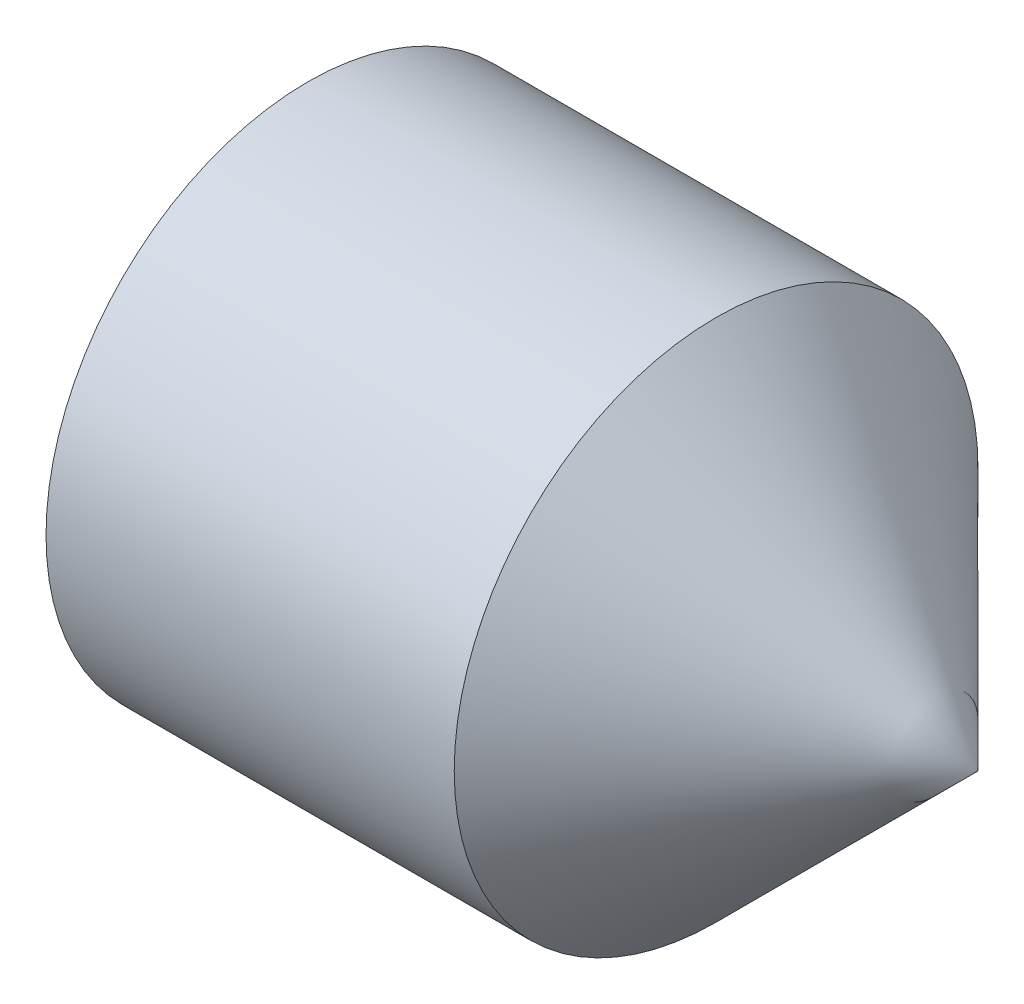
ISO-10303-21;
HEADER;
FILE_DESCRIPTION(('STEP AP214'),'2;1');
FILE_NAME('part.step','',(''),(''),'','','');
FILE_SCHEMA(('AUTOMOTIVE_DESIGN { 1 0 10303 214 1 1 1 1 }'));
ENDSEC;
DATA;
#1=APPLICATION_CONTEXT('core data for automotive mechanical design processes');
#2=APPLICATION_PROTOCOL_DEFINITION('international standard','automotive_design',2000,#1);
#3=PRODUCT_CONTEXT('',#1,'mechanical');
#4=PRODUCT('Part','Part','',(#3));
#5=PRODUCT_RELATED_PRODUCT_CATEGORY('part','',(#4));
#6=PRODUCT_DEFINITION_FORMATION('','',#4);
#7=PRODUCT_DEFINITION_CONTEXT('part definition',#1,'design');
#8=PRODUCT_DEFINITION('design','',#6,#7);
#9=PRODUCT_DEFINITION_SHAPE('','',#8);
#10=(LENGTH_UNIT() NAMED_UNIT(*) SI_UNIT(.MILLI.,.METRE.));
#11=(NAMED_UNIT(*) PLANE_ANGLE_UNIT() SI_UNIT($,.RADIAN.));
#12=(NAMED_UNIT(*) SI_UNIT($,.STERADIAN.) SOLID_ANGLE_UNIT());
#13=UNCERTAINTY_MEASURE_WITH_UNIT(LENGTH_MEASURE(1.E-05),#10,'distance_accuracy_value','');
#14=(GEOMETRIC_REPRESENTATION_CONTEXT(3) GLOBAL_UNCERTAINTY_ASSIGNED_CONTEXT((#13)) GLOBAL_UNIT_ASSIGNED_CONTEXT((#10,
#11,#12)) REPRESENTATION_CONTEXT('',''));
#15=CARTESIAN_POINT('',(0.,0.,0.));
#16=DIRECTION('',(0.,0.,1.));
#17=DIRECTION('',(1.,0.,0.));
#18=AXIS2_PLACEMENT_3D('',#15,#16,#17);
#19=CARTESIAN_POINT('',(0.,0.,0.));
#20=DIRECTION('',(-1.,0.,0.));
#21=DIRECTION('',(0.,0.,1.));
#22=AXIS2_PLACEMENT_3D('',#19,#20,#21);
#23=PLANE('',#22);
#24=CARTESIAN_POINT('',(0.,0.,0.));
#25=DIRECTION('',(-1.,0.,0.));
#26=DIRECTION('',(0.,0.,1.));
#27=AXIS2_PLACEMENT_3D('',#24,#25,#26);
#28=CIRCLE('',#27,1.2195);
#29=CARTESIAN_POINT('',(0.,0.,1.2195));
#30=VERTEX_POINT('',#29);
#31=EDGE_CURVE('E13',#30,#30,#28,.T.);
#32=ORIENTED_EDGE('',*,*,#31,.T.);
#33=EDGE_LOOP('',(#32));
#34=FACE_BOUND('',#33,.T.);
#35=DIRECTION('',(0.,0.,-1.));
#36=VECTOR('',#35,1.);
#37=CARTESIAN_POINT('',(0.,0.750000000000003,0.433012701892217));
#38=LINE('',#37,#36);
#39=CARTESIAN_POINT('',(0.,0.750000000000003,0.433012701892217));
#40=VERTEX_POINT('',#39);
#41=CARTESIAN_POINT('',(0.,0.750000000000003,-0.433012701892222));
#42=VERTEX_POINT('',#41);
#43=EDGE_CURVE('E107',#40,#42,#38,.T.);
#44=ORIENTED_EDGE('',*,*,#43,.F.);
#45=DIRECTION('',(0.,-0.866025403784439,0.5));
#46=VECTOR('',#45,1.);
#47=CARTESIAN_POINT('',(0.,0.750000000000003,0.433012701892217));
#48=LINE('',#47,#46);
#49=CARTESIAN_POINT('',(0.,0.,0.866025403784436));
#50=VERTEX_POINT('',#49);
#51=EDGE_CURVE('E60',#40,#50,#48,.T.);
#52=ORIENTED_EDGE('',*,*,#51,.T.);
#53=DIRECTION('',(0.,0.866025403784439,0.5));
#54=VECTOR('',#53,1.);
#55=CARTESIAN_POINT('',(0.,-0.749999999999997,0.433012701892217));
#56=LINE('',#55,#54);
#57=CARTESIAN_POINT('',(0.,-0.749999999999997,0.433012701892217));
#58=VERTEX_POINT('',#57);
#59=EDGE_CURVE('E113',#58,#50,#56,.T.);
#60=ORIENTED_EDGE('',*,*,#59,.F.);
#61=DIRECTION('',(0.,0.,-1.));
#62=VECTOR('',#61,1.);
#63=CARTESIAN_POINT('',(0.,-0.749999999999997,0.433012701892217));
#64=LINE('',#63,#62);
#65=CARTESIAN_POINT('',(0.,-0.749999999999997,-0.433012701892222));
#66=VERTEX_POINT('',#65);
#67=EDGE_CURVE('E133',#58,#66,#64,.T.);
#68=ORIENTED_EDGE('',*,*,#67,.T.);
#69=DIRECTION('',(0.,0.866025403784438,-0.5));
#70=VECTOR('',#69,1.);
#71=CARTESIAN_POINT('',(0.,-0.749999999999997,-0.433012701892222));
#72=LINE('',#71,#70);
#73=CARTESIAN_POINT('',(0.,0.,-0.866025403784441));
#74=VERTEX_POINT('',#73);
#75=EDGE_CURVE('E136',#66,#74,#72,.T.);
#76=ORIENTED_EDGE('',*,*,#75,.T.);
#77=DIRECTION('',(0.,-0.866025403784439,-0.5));
#78=VECTOR('',#77,1.);
#79=CARTESIAN_POINT('',(0.,0.750000000000003,-0.433012701892222));
#80=LINE('',#79,#78);
#81=EDGE_CURVE('E139',#42,#74,#80,.T.);
#82=ORIENTED_EDGE('',*,*,#81,.F.);
#83=EDGE_LOOP('',(#44,#52,#60,#68,#76,#82));
#84=FACE_BOUND('',#83,.T.);
#85=ADVANCED_FACE('F46',(#34,#84),#23,.T.);
#86=CARTESIAN_POINT('',(0.,0.,0.));
#87=DIRECTION('',(1.,0.,0.));
#88=DIRECTION('',(0.,0.,-1.));
#89=AXIS2_PLACEMENT_3D('',#86,#87,#88);
#90=CONICAL_SURFACE('',#89,1.2195,1.0471975511966);
#91=CARTESIAN_POINT('',(0.161946750507689,0.,0.));
#92=DIRECTION('',(-1.,0.,0.));
#93=DIRECTION('',(0.,0.,1.));
#94=AXIS2_PLACEMENT_3D('',#91,#92,#93);
#95=CIRCLE('',#94,1.5);
#96=CARTESIAN_POINT('',(0.161946750507689,0.,1.5));
#97=VERTEX_POINT('',#96);
#98=EDGE_CURVE('E53',#97,#97,#95,.T.);
#99=ORIENTED_EDGE('',*,*,#98,.T.);
#100=EDGE_LOOP('',(#99));
#101=FACE_BOUND('',#100,.T.);
#102=ORIENTED_EDGE('',*,*,#31,.F.);
#103=EDGE_LOOP('',(#102));
#104=FACE_BOUND('',#103,.T.);
#105=ADVANCED_FACE('F156',(#101,#104),#90,.T.);
#106=CARTESIAN_POINT('',(-12.7,0.,0.));
#107=DIRECTION('',(-1.,0.,0.));
#108=DIRECTION('',(0.,0.,1.));
#109=AXIS2_PLACEMENT_3D('',#106,#107,#108);
#110=CYLINDRICAL_SURFACE('',#109,1.5);
#111=CARTESIAN_POINT('',(2.50000000000001,0.,0.));
#112=DIRECTION('',(-1.,0.,0.));
#113=DIRECTION('',(0.,0.,1.));
#114=AXIS2_PLACEMENT_3D('',#111,#112,#113);
#115=CIRCLE('',#114,1.5);
#116=CARTESIAN_POINT('',(2.50000000000001,0.,1.5));
#117=VERTEX_POINT('',#116);
#118=EDGE_CURVE('E114',#117,#117,#115,.T.);
#119=ORIENTED_EDGE('',*,*,#118,.T.);
#120=EDGE_LOOP('',(#119));
#121=FACE_BOUND('',#120,.T.);
#122=ORIENTED_EDGE('',*,*,#98,.F.);
#123=EDGE_LOOP('',(#122));
#124=FACE_BOUND('',#123,.T.);
#125=ADVANCED_FACE('F159',(#121,#124),#110,.T.);
#126=CARTESIAN_POINT('',(2.50000000000001,0.,0.));
#127=DIRECTION('',(-1.,0.,0.));
#128=DIRECTION('',(0.,0.,1.));
#129=AXIS2_PLACEMENT_3D('',#126,#127,#128);
#130=CONICAL_SURFACE('',#129,1.5,0.785398163397451);
#131=CARTESIAN_POINT('',(4.,0.,0.));
#132=VERTEX_POINT('',#131);
#133=VERTEX_LOOP('',#132);
#134=FACE_BOUND('',#133,.T.);
#135=ORIENTED_EDGE('',*,*,#118,.F.);
#136=EDGE_LOOP('',(#135));
#137=FACE_BOUND('',#136,.T.);
#138=ADVANCED_FACE('F161',(#134,#137),#130,.T.);
#139=CARTESIAN_POINT('',(2.,0.750000000000003,0.433012701892217));
#140=DIRECTION('',(0.,-0.5,-0.866025403784439));
#141=DIRECTION('',(0.,0.866025403784439,-0.5));
#142=AXIS2_PLACEMENT_3D('',#139,#140,#141);
#143=PLANE('',#142);
#144=ORIENTED_EDGE('',*,*,#51,.F.);
#145=DIRECTION('',(-1.,0.,0.));
#146=VECTOR('',#145,1.);
#147=CARTESIAN_POINT('',(2.,0.750000000000003,0.433012701892217));
#148=LINE('',#147,#146);
#149=CARTESIAN_POINT('',(2.,0.750000000000003,0.433012701892217));
#150=VERTEX_POINT('',#149);
#151=EDGE_CURVE('E101',#150,#40,#148,.T.);
#152=ORIENTED_EDGE('',*,*,#151,.F.);
#153=DIRECTION('',(0.,-0.866025403784439,0.5));
#154=VECTOR('',#153,1.);
#155=CARTESIAN_POINT('',(2.,0.750000000000003,0.433012701892217));
#156=LINE('',#155,#154);
#157=CARTESIAN_POINT('',(2.,0.,0.866025403784436));
#158=VERTEX_POINT('',#157);
#159=EDGE_CURVE('E96',#150,#158,#156,.T.);
#160=ORIENTED_EDGE('',*,*,#159,.T.);
#161=DIRECTION('',(-1.,0.,0.));
#162=VECTOR('',#161,1.);
#163=CARTESIAN_POINT('',(2.,0.,0.866025403784436));
#164=LINE('',#163,#162);
#165=EDGE_CURVE('E99',#158,#50,#164,.T.);
#166=ORIENTED_EDGE('',*,*,#165,.T.);
#167=EDGE_LOOP('',(#144,#152,#160,#166));
#168=FACE_BOUND('',#167,.T.);
#169=ADVANCED_FACE('F98',(#168),#143,.T.);
#170=CARTESIAN_POINT('',(2.,-0.749999999999997,0.433012701892217));
#171=DIRECTION('',(0.,-0.5,0.866025403784439));
#172=DIRECTION('',(0.,-0.866025403784439,-0.5));
#173=AXIS2_PLACEMENT_3D('',#170,#171,#172);
#174=PLANE('',#173);
#175=ORIENTED_EDGE('',*,*,#59,.T.);
#176=ORIENTED_EDGE('',*,*,#165,.F.);
#177=DIRECTION('',(0.,0.866025403784439,0.5));
#178=VECTOR('',#177,1.);
#179=CARTESIAN_POINT('',(2.,-0.749999999999997,0.433012701892217));
#180=LINE('',#179,#178);
#181=CARTESIAN_POINT('',(2.,-0.749999999999997,0.433012701892217));
#182=VERTEX_POINT('',#181);
#183=EDGE_CURVE('E106',#182,#158,#180,.T.);
#184=ORIENTED_EDGE('',*,*,#183,.F.);
#185=DIRECTION('',(-1.,0.,0.));
#186=VECTOR('',#185,1.);
#187=CARTESIAN_POINT('',(2.,-0.749999999999997,0.433012701892217));
#188=LINE('',#187,#186);
#189=EDGE_CURVE('E115',#182,#58,#188,.T.);
#190=ORIENTED_EDGE('',*,*,#189,.T.);
#191=EDGE_LOOP('',(#175,#176,#184,#190));
#192=FACE_BOUND('',#191,.T.);
#193=ADVANCED_FACE('F111',(#192),#174,.F.);
#194=CARTESIAN_POINT('',(2.,-0.749999999999997,0.433012701892217));
#195=DIRECTION('',(0.,1.,0.));
#196=DIRECTION('',(0.,0.,1.));
#197=AXIS2_PLACEMENT_3D('',#194,#195,#196);
#198=PLANE('',#197);
#199=ORIENTED_EDGE('',*,*,#67,.F.);
#200=ORIENTED_EDGE('',*,*,#189,.F.);
#201=DIRECTION('',(0.,0.,-1.));
#202=VECTOR('',#201,1.);
#203=CARTESIAN_POINT('',(2.,-0.749999999999997,0.433012701892217));
#204=LINE('',#203,#202);
#205=CARTESIAN_POINT('',(2.,-0.749999999999997,-0.433012701892222));
#206=VERTEX_POINT('',#205);
#207=EDGE_CURVE('E120',#182,#206,#204,.T.);
#208=ORIENTED_EDGE('',*,*,#207,.T.);
#209=DIRECTION('',(-1.,0.,0.));
#210=VECTOR('',#209,1.);
#211=CARTESIAN_POINT('',(2.,-0.749999999999997,-0.433012701892222));
#212=LINE('',#211,#210);
#213=EDGE_CURVE('E149',#206,#66,#212,.T.);
#214=ORIENTED_EDGE('',*,*,#213,.T.);
#215=EDGE_LOOP('',(#199,#200,#208,#214));
#216=FACE_BOUND('',#215,.T.);
#217=ADVANCED_FACE('F189',(#216),#198,.T.);
#218=CARTESIAN_POINT('',(2.,-0.749999999999997,-0.433012701892222));
#219=DIRECTION('',(0.,0.5,0.866025403784438));
#220=DIRECTION('',(0.,-0.866025403784439,0.5));
#221=AXIS2_PLACEMENT_3D('',#218,#219,#220);
#222=PLANE('',#221);
#223=ORIENTED_EDGE('',*,*,#75,.F.);
#224=ORIENTED_EDGE('',*,*,#213,.F.);
#225=DIRECTION('',(0.,0.866025403784438,-0.5));
#226=VECTOR('',#225,1.);
#227=CARTESIAN_POINT('',(2.,-0.749999999999997,-0.433012701892222));
#228=LINE('',#227,#226);
#229=CARTESIAN_POINT('',(2.,0.,-0.866025403784441));
#230=VERTEX_POINT('',#229);
#231=EDGE_CURVE('E122',#206,#230,#228,.T.);
#232=ORIENTED_EDGE('',*,*,#231,.T.);
#233=DIRECTION('',(-1.,0.,0.));
#234=VECTOR('',#233,1.);
#235=CARTESIAN_POINT('',(2.,0.,-0.866025403784441));
#236=LINE('',#235,#234);
#237=EDGE_CURVE('E147',#230,#74,#236,.T.);
#238=ORIENTED_EDGE('',*,*,#237,.T.);
#239=EDGE_LOOP('',(#223,#224,#232,#238));
#240=FACE_BOUND('',#239,.T.);
#241=ADVANCED_FACE('F185',(#240),#222,.T.);
#242=CARTESIAN_POINT('',(2.,0.750000000000003,-0.433012701892222));
#243=DIRECTION('',(0.,0.5,-0.866025403784439));
#244=DIRECTION('',(0.,0.866025403784439,0.5));
#245=AXIS2_PLACEMENT_3D('',#242,#243,#244);
#246=PLANE('',#245);
#247=ORIENTED_EDGE('',*,*,#81,.T.);
#248=ORIENTED_EDGE('',*,*,#237,.F.);
#249=DIRECTION('',(0.,-0.866025403784439,-0.5));
#250=VECTOR('',#249,1.);
#251=CARTESIAN_POINT('',(2.,0.750000000000003,-0.433012701892222));
#252=LINE('',#251,#250);
#253=CARTESIAN_POINT('',(2.,0.750000000000003,-0.433012701892222));
#254=VERTEX_POINT('',#253);
#255=EDGE_CURVE('E126',#254,#230,#252,.T.);
#256=ORIENTED_EDGE('',*,*,#255,.F.);
#257=DIRECTION('',(-1.,0.,0.));
#258=VECTOR('',#257,1.);
#259=CARTESIAN_POINT('',(2.,0.750000000000003,-0.433012701892222));
#260=LINE('',#259,#258);
#261=EDGE_CURVE('E145',#254,#42,#260,.T.);
#262=ORIENTED_EDGE('',*,*,#261,.T.);
#263=EDGE_LOOP('',(#247,#248,#256,#262));
#264=FACE_BOUND('',#263,.T.);
#265=ADVANCED_FACE('F182',(#264),#246,.F.);
#266=CARTESIAN_POINT('',(2.,0.750000000000003,0.433012701892217));
#267=DIRECTION('',(0.,1.,0.));
#268=DIRECTION('',(0.,0.,1.));
#269=AXIS2_PLACEMENT_3D('',#266,#267,#268);
#270=PLANE('',#269);
#271=ORIENTED_EDGE('',*,*,#43,.T.);
#272=ORIENTED_EDGE('',*,*,#261,.F.);
#273=DIRECTION('',(0.,0.,-1.));
#274=VECTOR('',#273,1.);
#275=CARTESIAN_POINT('',(2.,0.750000000000003,0.433012701892217));
#276=LINE('',#275,#274);
#277=EDGE_CURVE('E129',#150,#254,#276,.T.);
#278=ORIENTED_EDGE('',*,*,#277,.F.);
#279=ORIENTED_EDGE('',*,*,#151,.T.);
#280=EDGE_LOOP('',(#271,#272,#278,#279));
#281=FACE_BOUND('',#280,.T.);
#282=ADVANCED_FACE('F178',(#281),#270,.F.);
#283=CARTESIAN_POINT('',(2.,0.750000000000003,0.433012701892217));
#284=DIRECTION('',(1.,0.,0.));
#285=DIRECTION('',(0.,0.,-1.));
#286=AXIS2_PLACEMENT_3D('',#283,#284,#285);
#287=PLANE('',#286);
#288=ORIENTED_EDGE('',*,*,#159,.F.);
#289=ORIENTED_EDGE('',*,*,#277,.T.);
#290=ORIENTED_EDGE('',*,*,#255,.T.);
#291=ORIENTED_EDGE('',*,*,#231,.F.);
#292=ORIENTED_EDGE('',*,*,#207,.F.);
#293=ORIENTED_EDGE('',*,*,#183,.T.);
#294=EDGE_LOOP('',(#288,#289,#290,#291,#292,#293));
#295=FACE_BOUND('',#294,.T.);
#296=ADVANCED_FACE('F118',(#295),#287,.F.);
#297=CLOSED_SHELL('',(#85,#105,#125,#138,#169,#193,#217,#241,#265,#282,#296));
#298=MANIFOLD_SOLID_BREP('B2',#297);
#299=ADVANCED_BREP_SHAPE_REPRESENTATION('',(#18,#298),#14);
#300=SHAPE_DEFINITION_REPRESENTATION(#9,#299);
ENDSEC;
END-ISO-10303-21;
